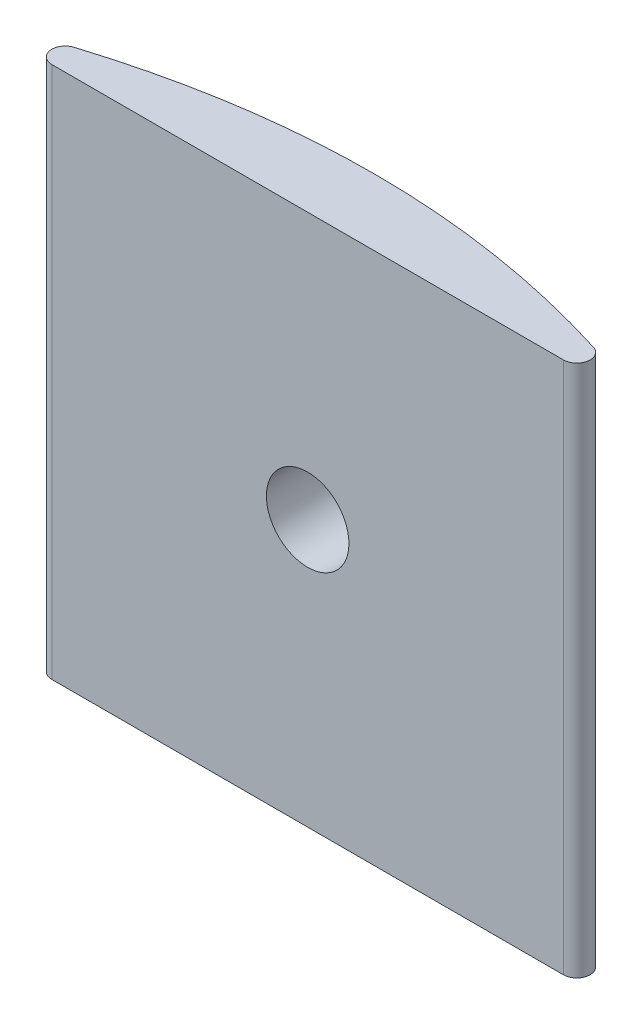
ISO-10303-21;
HEADER;
FILE_DESCRIPTION(('STEP AP214'),'2;1');
FILE_NAME('part.step','',(''),(''),'','','');
FILE_SCHEMA(('AUTOMOTIVE_DESIGN { 1 0 10303 214 1 1 1 1 }'));
ENDSEC;
DATA;
#1=APPLICATION_CONTEXT('core data for automotive mechanical design processes');
#2=APPLICATION_PROTOCOL_DEFINITION('international standard','automotive_design',2000,#1);
#3=PRODUCT_CONTEXT('',#1,'mechanical');
#4=PRODUCT('Part','Part','',(#3));
#5=PRODUCT_RELATED_PRODUCT_CATEGORY('part','',(#4));
#6=PRODUCT_DEFINITION_FORMATION('','',#4);
#7=PRODUCT_DEFINITION_CONTEXT('part definition',#1,'design');
#8=PRODUCT_DEFINITION('design','',#6,#7);
#9=PRODUCT_DEFINITION_SHAPE('','',#8);
#10=(LENGTH_UNIT() NAMED_UNIT(*) SI_UNIT(.MILLI.,.METRE.));
#11=(NAMED_UNIT(*) PLANE_ANGLE_UNIT() SI_UNIT($,.RADIAN.));
#12=(NAMED_UNIT(*) SI_UNIT($,.STERADIAN.) SOLID_ANGLE_UNIT());
#13=UNCERTAINTY_MEASURE_WITH_UNIT(LENGTH_MEASURE(1.E-05),#10,'distance_accuracy_value','');
#14=(GEOMETRIC_REPRESENTATION_CONTEXT(3) GLOBAL_UNCERTAINTY_ASSIGNED_CONTEXT((#13)) GLOBAL_UNIT_ASSIGNED_CONTEXT((#10,
#11,#12)) REPRESENTATION_CONTEXT('',''));
#15=CARTESIAN_POINT('',(0.,0.,0.));
#16=DIRECTION('',(0.,0.,1.));
#17=DIRECTION('',(1.,0.,0.));
#18=AXIS2_PLACEMENT_3D('',#15,#16,#17);
#19=CARTESIAN_POINT('',(0.,20.,0.));
#20=CARTESIAN_POINT('',(12.5,20.,-5.));
#21=CARTESIAN_POINT('',(25.,20.,0.));
#22=B_SPLINE_CURVE_WITH_KNOTS('',2,(#19,#20,#21),.UNSPECIFIED.,.F.,.F.,(3,3),(0.,1.),.UNSPECIFIED.);
#23=DIRECTION('',(0.,-1.,0.));
#24=VECTOR('',#23,1.);
#25=SURFACE_OF_LINEAR_EXTRUSION('',#22,#24);
#26=CARTESIAN_POINT('',(14.05,10.,-2.46156));
#27=CARTESIAN_POINT('',(14.0499940283241,9.91298168500598,-2.46156067406048));
#28=CARTESIAN_POINT('',(14.0426374698178,9.82587412846278,-2.46192811616464));
#29=CARTESIAN_POINT('',(14.0207537805477,9.6971544704674,-2.46299758025628));
#30=CARTESIAN_POINT('',(14.0116392415127,9.65453767659757,-2.46344102364616));
#31=CARTESIAN_POINT('',(13.9898504205098,9.57018185303042,-2.46448745487428));
#32=CARTESIAN_POINT('',(13.9771730071062,9.52844363035994,-2.46509058303348));
#33=CARTESIAN_POINT('',(13.9339601283127,9.40516954055419,-2.46711360260464));
#34=CARTESIAN_POINT('',(13.8982146895003,9.32540283821195,-2.46874865405606));
#35=CARTESIAN_POINT('',(13.8138391854986,9.17301007503597,-2.47240945699378));
#36=CARTESIAN_POINT('',(13.7652087748773,9.10038420571166,-2.4744352189542));
#37=CARTESIAN_POINT('',(13.683675547016,8.99834235373567,-2.47759441395277));
#38=CARTESIAN_POINT('',(13.6550318586583,8.96544692533521,-2.47866876512411));
#39=CARTESIAN_POINT('',(13.5951080670479,8.90221390943691,-2.48082619738266));
#40=CARTESIAN_POINT('',(13.5638305253839,8.87187389280538,-2.48190926908205));
#41=CARTESIAN_POINT('',(13.4662993242777,8.7849542996055,-2.48512764439875));
#42=CARTESIAN_POINT('',(13.3963268925576,8.73244995418019,-2.48723292405231));
#43=CARTESIAN_POINT('',(13.2485535670975,8.63993358112362,-2.49112202212115));
#44=CARTESIAN_POINT('',(13.170748793574,8.59992778536453,-2.49290567998655));
#45=CARTESIAN_POINT('',(13.0095071512466,8.53354192440912,-2.49595028726416));
#46=CARTESIAN_POINT('',(12.9260703246958,8.50716175700289,-2.49721124059732));
#47=CARTESIAN_POINT('',(12.7560170614987,8.46880834894735,-2.49906681386217));
#48=CARTESIAN_POINT('',(12.6694033208811,8.45682317100461,-2.49966198587634));
#49=CARTESIAN_POINT('',(12.495390756836,8.447560103372,-2.50012075741972));
#50=CARTESIAN_POINT('',(12.4079919395218,8.45028209925911,-2.49998436264056));
#51=CARTESIAN_POINT('',(12.2349718871364,8.47034699480099,-2.49899583873907));
#52=CARTESIAN_POINT('',(12.1493491550996,8.48767702257524,-2.49814433973392));
#53=CARTESIAN_POINT('',(11.982229574397,8.5364458803427,-2.49582241624913));
#54=CARTESIAN_POINT('',(11.9007327429486,8.56788476920665,-2.49435198918695));
#55=CARTESIAN_POINT('',(11.7441369607604,8.64399366213488,-2.49095698591494));
#56=CARTESIAN_POINT('',(11.6690408661277,8.68866953335545,-2.48903220839602));
#57=CARTESIAN_POINT('',(11.5274094746687,8.78997991053617,-2.48494546064919));
#58=CARTESIAN_POINT('',(11.4608742372854,8.84661449952527,-2.4827834887745));
#59=CARTESIAN_POINT('',(11.3381782625001,8.9703073731654,-2.47846315222799));
#60=CARTESIAN_POINT('',(11.2820287719745,9.03737681488298,-2.476304793946));
#61=CARTESIAN_POINT('',(11.1817848204454,9.1799963296013,-2.47223727416246));
#62=CARTESIAN_POINT('',(11.1376903623448,9.25554640464424,-2.47032811272091));
#63=CARTESIAN_POINT('',(11.0628091904261,9.41298927140015,-2.46697426525031));
#64=CARTESIAN_POINT('',(11.0320228831723,9.49488225679905,-2.46552959341176));
#65=CARTESIAN_POINT('',(10.9846393503187,9.66268331197014,-2.46326797284403));
#66=CARTESIAN_POINT('',(10.968042019832,9.7485913520575,-2.46245101947467));
#67=CARTESIAN_POINT('',(10.9495214603873,9.92188609934678,-2.46153766130641));
#68=CARTESIAN_POINT('',(10.9475826485359,10.0092711373028,-2.46144049133637));
#69=CARTESIAN_POINT('',(10.9583934978584,10.183125310998,-2.46197563990701));
#70=CARTESIAN_POINT('',(10.9711431113735,10.269594449708,-2.46260795608076));
#71=CARTESIAN_POINT('',(11.0109559858685,10.4391185690218,-2.46453023708233));
#72=CARTESIAN_POINT('',(11.0380121240511,10.522175226443,-2.46581987463768));
#73=CARTESIAN_POINT('',(11.1056628084661,10.6825683599149,-2.46891138231064));
#74=CARTESIAN_POINT('',(11.1462574317343,10.7599048034138,-2.47071325534293));
#75=CARTESIAN_POINT('',(11.2398727047006,10.9067338322065,-2.47462821924834));
#76=CARTESIAN_POINT('',(11.2929038118416,10.9762197429731,-2.47674157147569));
#77=CARTESIAN_POINT('',(11.4098714091259,11.1053081368786,-2.48104049508875));
#78=CARTESIAN_POINT('',(11.4738079680193,11.1649105577055,-2.48322606692967));
#79=CARTESIAN_POINT('',(11.6108385394967,11.2725924688347,-2.48742530096395));
#80=CARTESIAN_POINT('',(11.6839404733049,11.3206618856903,-2.48943881189052));
#81=CARTESIAN_POINT('',(11.8371865905755,11.4038444620383,-2.49306466684116));
#82=CARTESIAN_POINT('',(11.9173307436588,11.4389576774185,-2.49467701259571));
#83=CARTESIAN_POINT('',(12.0823491376962,11.4952133574814,-2.49731786474085));
#84=CARTESIAN_POINT('',(12.1672211802878,11.5163622574217,-2.49834664003083));
#85=CARTESIAN_POINT('',(12.3393160112519,11.5441106564695,-2.49970531562523));
#86=CARTESIAN_POINT('',(12.4265387865924,11.5507102362184,-2.50003521980323));
#87=CARTESIAN_POINT('',(12.6007624264139,11.5491695446599,-2.49995881743699));
#88=CARTESIAN_POINT('',(12.6877634286275,11.5410451004349,-2.49955330140705));
#89=CARTESIAN_POINT('',(12.8591548365232,11.5103284282013,-2.49805374188571));
#90=CARTESIAN_POINT('',(12.9435452372192,11.4877361725616,-2.49695969707934));
#91=CARTESIAN_POINT('',(13.1073707684764,11.428695816842,-2.49420490731198));
#92=CARTESIAN_POINT('',(13.1868058609895,11.3922476103873,-2.49254415800031));
#93=CARTESIAN_POINT('',(13.3004375434686,11.3280436716001,-2.48977196344951));
#94=CARTESIAN_POINT('',(13.3374010286778,11.3050485443818,-2.48880084490337));
#95=CARTESIAN_POINT('',(13.4093006195136,11.2560124375212,-2.48679142190012));
#96=CARTESIAN_POINT('',(13.4442347409194,11.2299685495157,-2.48575305371902));
#97=CARTESIAN_POINT('',(13.5455806167787,11.1475343183684,-2.48258109269406));
#98=CARTESIAN_POINT('',(13.6085566360424,11.0868296570192,-2.4803901128261));
#99=CARTESIAN_POINT('',(13.7234111007599,10.9556997734923,-2.47610529957199));
#100=CARTESIAN_POINT('',(13.7752897532768,10.8852747327251,-2.47401146437381));
#101=CARTESIAN_POINT('',(13.8437037597395,10.7738668911363,-2.47111968197417));
#102=CARTESIAN_POINT('',(13.8649610202485,10.7357197728462,-2.47019628767495));
#103=CARTESIAN_POINT('',(13.9041694186217,10.6578069084438,-2.46845904527983));
#104=CARTESIAN_POINT('',(13.9221234597299,10.6180426215865,-2.4676451011577));
#105=CARTESIAN_POINT('',(13.9708222042235,10.4967386279759,-2.46540408304595));
#106=CARTESIAN_POINT('',(13.996478908977,10.4130647960768,-2.46417451471054));
#107=CARTESIAN_POINT('',(14.0265747258418,10.274073531764,-2.46271512291367));
#108=CARTESIAN_POINT('',(14.0353465814056,10.2196410954298,-2.46228393878701));
#109=CARTESIAN_POINT('',(14.0470611064517,10.1101510297617,-2.46170616406727));
#110=CARTESIAN_POINT('',(14.0500037808125,10.0550934009511,-2.46155957323599));
#111=CARTESIAN_POINT('',(14.05,10.,-2.46156));
#112=B_SPLINE_CURVE_WITH_KNOTS('',3,(#26,#27,#28,#29,#30,#31,#32,#33,#34,#35,#36,#37,#38,#39,
#40,#41,#42,#43,#44,#45,#46,#47,#48,#49,#50,#51,#52,#53,#54,#55,#56,#57,#58,#59,#60,#61,#62,#63,
#64,#65,#66,#67,#68,#69,#70,#71,#72,#73,#74,#75,#76,#77,#78,#79,#80,#81,#82,#83,#84,#85,#86,#87,
#88,#89,#90,#91,#92,#93,#94,#95,#96,#97,#98,#99,#100,#101,#102,#103,#104,#105,#106,#107,#108,
#109,#110,#111),.UNSPECIFIED.,.T.,.F.,(4,2,2,2,2,2,2,2,2,2,2,2,2,2,2,2,2,2,2,2,2,2,2,2,2,2,2,2,
2,2,2,2,2,2,2,2,2,2,2,2,2,2,4),(0.,0.260819371382533,0.391441612309753,0.522179019038286,
0.78313882704424,1.04410563180254,1.17486450323735,1.30549764053551,1.56666817248886,
1.82796871899603,2.08926730538134,2.35034905546354,2.61142877431108,2.87227868271852,
3.13312967956018,3.39409646932867,3.65506507103994,3.91631464571181,4.17756428329445,
4.43882190149498,4.70007758842455,4.96105550562596,5.22203257604519,5.48287983583603,
5.74372857990769,6.00479745485137,6.26586797568461,6.52716570385748,6.78846230488149,
7.04963840685565,7.31081306122508,7.57170714138983,7.83260171981731,8.09349830122256,
8.22399557134984,8.35461835958201,8.61579328930375,8.87696334540044,9.00786420752719,
9.1386494637042,9.39979243213947,9.56492362584552,9.73005468135231),.UNSPECIFIED.);
#113=CARTESIAN_POINT('',(14.05,10.,-2.46156));
#114=VERTEX_POINT('',#113);
#115=EDGE_CURVE('E106',#114,#114,#112,.T.);
#116=ORIENTED_EDGE('',*,*,#115,.F.);
#117=EDGE_LOOP('',(#116));
#118=FACE_BOUND('',#117,.T.);
#119=CARTESIAN_POINT('',(2.74450155231035,20.,-0.977284000593998));
#120=VERTEX_POINT('',#119);
#121=CARTESIAN_POINT('',(22.2554984476896,20.,-0.977284000593998));
#122=VERTEX_POINT('',#121);
#123=EDGE_CURVE('E115',#120,#122,#22,.T.);
#124=ORIENTED_EDGE('',*,*,#123,.T.);
#125=DIRECTION('',(0.,-1.,0.));
#126=VECTOR('',#125,1.);
#127=CARTESIAN_POINT('',(22.2554984476896,20.,-0.977284000594));
#128=LINE('',#127,#126);
#129=CARTESIAN_POINT('',(22.2554984476896,0.,-0.977284000594));
#130=VERTEX_POINT('',#129);
#131=EDGE_CURVE('E98',#122,#130,#128,.T.);
#132=ORIENTED_EDGE('',*,*,#131,.T.);
#133=CARTESIAN_POINT('',(0.,0.,0.));
#134=CARTESIAN_POINT('',(12.5,0.,-5.));
#135=CARTESIAN_POINT('',(25.,0.,0.));
#136=B_SPLINE_CURVE_WITH_KNOTS('',2,(#133,#134,#135),.UNSPECIFIED.,.F.,.F.,(3,3),(0.,1.),.UNSPECIFIED.);
#137=CARTESIAN_POINT('',(2.74450155231035,0.,-0.977284000593998));
#138=VERTEX_POINT('',#137);
#139=EDGE_CURVE('E91',#138,#130,#136,.T.);
#140=ORIENTED_EDGE('',*,*,#139,.F.);
#141=DIRECTION('',(0.,-1.,0.));
#142=VECTOR('',#141,1.);
#143=CARTESIAN_POINT('',(2.74450155231035,0.,-0.977284000593998));
#144=LINE('',#143,#142);
#145=EDGE_CURVE('E103',#138,#120,#144,.F.);
#146=ORIENTED_EDGE('',*,*,#145,.T.);
#147=EDGE_LOOP('',(#124,#132,#140,#146));
#148=FACE_BOUND('',#147,.T.);
#149=ADVANCED_FACE('F42',(#118,#148),#25,.T.);
#150=CARTESIAN_POINT('',(0.,20.,0.));
#151=DIRECTION('',(0.,0.,-1.));
#152=DIRECTION('',(-1.,0.,0.));
#153=AXIS2_PLACEMENT_3D('',#150,#151,#152);
#154=PLANE('',#153);
#155=CARTESIAN_POINT('',(12.5,10.,0.));
#156=DIRECTION('',(0.,0.,1.));
#157=DIRECTION('',(1.,0.,0.));
#158=AXIS2_PLACEMENT_3D('',#155,#156,#157);
#159=CIRCLE('',#158,1.55);
#160=CARTESIAN_POINT('',(14.05,10.,0.));
#161=VERTEX_POINT('',#160);
#162=EDGE_CURVE('E129',#161,#161,#159,.T.);
#163=ORIENTED_EDGE('',*,*,#162,.F.);
#164=EDGE_LOOP('',(#163));
#165=FACE_BOUND('',#164,.T.);
#166=DIRECTION('',(1.,0.,0.));
#167=VECTOR('',#166,1.);
#168=CARTESIAN_POINT('',(0.,0.,0.));
#169=LINE('',#168,#167);
#170=CARTESIAN_POINT('',(2.89349813877121,0.,0.));
#171=VERTEX_POINT('',#170);
#172=CARTESIAN_POINT('',(22.1065018612288,0.,0.));
#173=VERTEX_POINT('',#172);
#174=EDGE_CURVE('E92',#171,#173,#169,.T.);
#175=ORIENTED_EDGE('',*,*,#174,.T.);
#176=DIRECTION('',(0.,1.,0.));
#177=VECTOR('',#176,1.);
#178=CARTESIAN_POINT('',(22.1065018612288,20.,0.));
#179=LINE('',#178,#177);
#180=CARTESIAN_POINT('',(22.1065018612288,20.,0.));
#181=VERTEX_POINT('',#180);
#182=EDGE_CURVE('E60',#173,#181,#179,.T.);
#183=ORIENTED_EDGE('',*,*,#182,.T.);
#184=DIRECTION('',(1.,0.,0.));
#185=VECTOR('',#184,1.);
#186=CARTESIAN_POINT('',(0.,20.,0.));
#187=LINE('',#186,#185);
#188=CARTESIAN_POINT('',(2.89349813877121,20.,0.));
#189=VERTEX_POINT('',#188);
#190=EDGE_CURVE('E109',#189,#181,#187,.T.);
#191=ORIENTED_EDGE('',*,*,#190,.F.);
#192=DIRECTION('',(0.,1.,0.));
#193=VECTOR('',#192,1.);
#194=CARTESIAN_POINT('',(2.89349813877121,0.,0.));
#195=LINE('',#194,#193);
#196=EDGE_CURVE('E121',#189,#171,#195,.F.);
#197=ORIENTED_EDGE('',*,*,#196,.T.);
#198=EDGE_LOOP('',(#175,#183,#191,#197));
#199=FACE_BOUND('',#198,.T.);
#200=ADVANCED_FACE('F153',(#165,#199),#154,.F.);
#201=CARTESIAN_POINT('',(0.,20.,0.));
#202=DIRECTION('',(0.,1.,0.));
#203=DIRECTION('',(0.,0.,1.));
#204=AXIS2_PLACEMENT_3D('',#201,#202,#203);
#205=PLANE('',#204);
#206=ORIENTED_EDGE('',*,*,#190,.T.);
#207=CARTESIAN_POINT('',(22.1065018612288,20.,-0.5));
#208=DIRECTION('',(0.,1.,0.));
#209=DIRECTION('',(0.,0.,1.));
#210=AXIS2_PLACEMENT_3D('',#207,#208,#209);
#211=CIRCLE('',#210,0.5);
#212=EDGE_CURVE('E11',#181,#122,#211,.T.);
#213=ORIENTED_EDGE('',*,*,#212,.T.);
#214=ORIENTED_EDGE('',*,*,#123,.F.);
#215=CARTESIAN_POINT('',(2.89349813877121,20.,-0.5));
#216=DIRECTION('',(0.,1.,0.));
#217=DIRECTION('',(0.,0.,1.));
#218=AXIS2_PLACEMENT_3D('',#215,#216,#217);
#219=CIRCLE('',#218,0.5);
#220=EDGE_CURVE('E51',#120,#189,#219,.T.);
#221=ORIENTED_EDGE('',*,*,#220,.T.);
#222=EDGE_LOOP('',(#206,#213,#214,#221));
#223=FACE_BOUND('',#222,.T.);
#224=ADVANCED_FACE('F150',(#223),#205,.T.);
#225=CARTESIAN_POINT('',(0.,0.,0.));
#226=DIRECTION('',(0.,1.,0.));
#227=DIRECTION('',(0.,0.,1.));
#228=AXIS2_PLACEMENT_3D('',#225,#226,#227);
#229=PLANE('',#228);
#230=ORIENTED_EDGE('',*,*,#139,.T.);
#231=CARTESIAN_POINT('',(22.1065018612288,0.,-0.5));
#232=DIRECTION('',(0.,1.,0.));
#233=DIRECTION('',(0.,0.,1.));
#234=AXIS2_PLACEMENT_3D('',#231,#232,#233);
#235=CIRCLE('',#234,0.5);
#236=EDGE_CURVE('E97',#130,#173,#235,.F.);
#237=ORIENTED_EDGE('',*,*,#236,.T.);
#238=ORIENTED_EDGE('',*,*,#174,.F.);
#239=CARTESIAN_POINT('',(2.89349813877121,0.,-0.5));
#240=DIRECTION('',(0.,1.,0.));
#241=DIRECTION('',(0.,0.,1.));
#242=AXIS2_PLACEMENT_3D('',#239,#240,#241);
#243=CIRCLE('',#242,0.5);
#244=EDGE_CURVE('E88',#171,#138,#243,.F.);
#245=ORIENTED_EDGE('',*,*,#244,.T.);
#246=EDGE_LOOP('',(#230,#237,#238,#245));
#247=FACE_BOUND('',#246,.T.);
#248=ADVANCED_FACE('F90',(#247),#229,.F.);
#249=CARTESIAN_POINT('',(12.5,10.,-20.));
#250=DIRECTION('',(0.,0.,1.));
#251=DIRECTION('',(1.,0.,0.));
#252=AXIS2_PLACEMENT_3D('',#249,#250,#251);
#253=CYLINDRICAL_SURFACE('',#252,1.55);
#254=ORIENTED_EDGE('',*,*,#115,.T.);
#255=EDGE_LOOP('',(#254));
#256=FACE_BOUND('',#255,.T.);
#257=ORIENTED_EDGE('',*,*,#162,.T.);
#258=EDGE_LOOP('',(#257));
#259=FACE_BOUND('',#258,.T.);
#260=ADVANCED_FACE('F145',(#256,#259),#253,.F.);
#261=CARTESIAN_POINT('',(22.1065018612288,10.,-0.5));
#262=DIRECTION('',(0.,-1.,0.));
#263=DIRECTION('',(0.,0.,-1.));
#264=AXIS2_PLACEMENT_3D('',#261,#262,#263);
#265=CYLINDRICAL_SURFACE('',#264,0.5);
#266=ORIENTED_EDGE('',*,*,#212,.F.);
#267=ORIENTED_EDGE('',*,*,#182,.F.);
#268=ORIENTED_EDGE('',*,*,#236,.F.);
#269=ORIENTED_EDGE('',*,*,#131,.F.);
#270=EDGE_LOOP('',(#266,#267,#268,#269));
#271=FACE_BOUND('',#270,.T.);
#272=ADVANCED_FACE('F149',(#271),#265,.T.);
#273=CARTESIAN_POINT('',(2.89349813877121,10.,-0.5));
#274=DIRECTION('',(0.,-1.,0.));
#275=DIRECTION('',(0.,0.,-1.));
#276=AXIS2_PLACEMENT_3D('',#273,#274,#275);
#277=CYLINDRICAL_SURFACE('',#276,0.5);
#278=ORIENTED_EDGE('',*,*,#220,.F.);
#279=ORIENTED_EDGE('',*,*,#145,.F.);
#280=ORIENTED_EDGE('',*,*,#244,.F.);
#281=ORIENTED_EDGE('',*,*,#196,.F.);
#282=EDGE_LOOP('',(#278,#279,#280,#281));
#283=FACE_BOUND('',#282,.T.);
#284=ADVANCED_FACE('F44',(#283),#277,.T.);
#285=CLOSED_SHELL('',(#149,#200,#224,#248,#260,#272,#284));
#286=MANIFOLD_SOLID_BREP('B2',#285);
#287=ADVANCED_BREP_SHAPE_REPRESENTATION('',(#18,#286),#14);
#288=SHAPE_DEFINITION_REPRESENTATION(#9,#287);
ENDSEC;
END-ISO-10303-21;
